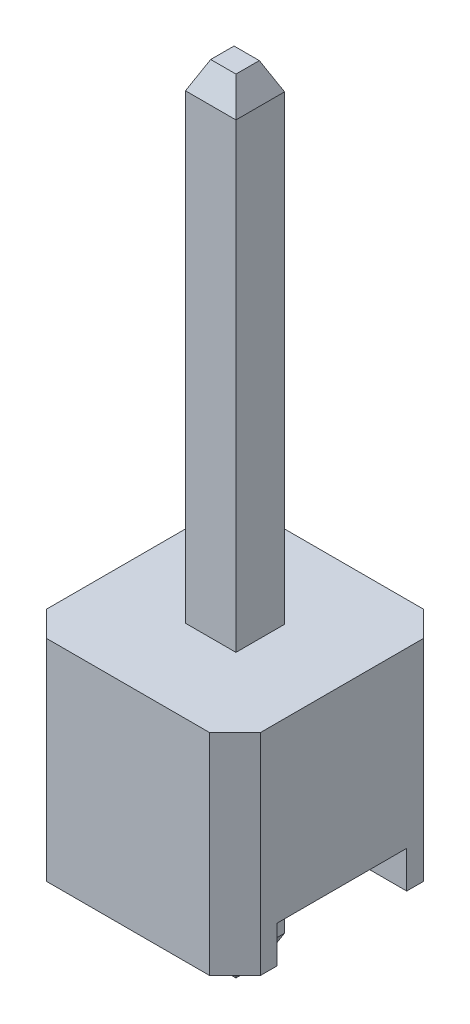
ISO-10303-21;
HEADER;
FILE_DESCRIPTION(('STEP AP214'),'2;1');
FILE_NAME('part.step','',(''),(''),'','','');
FILE_SCHEMA(('AUTOMOTIVE_DESIGN { 1 0 10303 214 1 1 1 1 }'));
ENDSEC;
DATA;
#1=APPLICATION_CONTEXT('core data for automotive mechanical design processes');
#2=APPLICATION_PROTOCOL_DEFINITION('international standard','automotive_design',2000,#1);
#3=PRODUCT_CONTEXT('',#1,'mechanical');
#4=PRODUCT('Part','Part','',(#3));
#5=PRODUCT_RELATED_PRODUCT_CATEGORY('part','',(#4));
#6=PRODUCT_DEFINITION_FORMATION('','',#4);
#7=PRODUCT_DEFINITION_CONTEXT('part definition',#1,'design');
#8=PRODUCT_DEFINITION('design','',#6,#7);
#9=PRODUCT_DEFINITION_SHAPE('','',#8);
#10=(LENGTH_UNIT() NAMED_UNIT(*) SI_UNIT(.MILLI.,.METRE.));
#11=(NAMED_UNIT(*) PLANE_ANGLE_UNIT() SI_UNIT($,.RADIAN.));
#12=(NAMED_UNIT(*) SI_UNIT($,.STERADIAN.) SOLID_ANGLE_UNIT());
#13=UNCERTAINTY_MEASURE_WITH_UNIT(LENGTH_MEASURE(1.E-05),#10,'distance_accuracy_value','');
#14=(GEOMETRIC_REPRESENTATION_CONTEXT(3) GLOBAL_UNCERTAINTY_ASSIGNED_CONTEXT((#13)) GLOBAL_UNIT_ASSIGNED_CONTEXT((#10,
#11,#12)) REPRESENTATION_CONTEXT('',''));
#15=CARTESIAN_POINT('',(0.,0.,0.));
#16=DIRECTION('',(0.,0.,1.));
#17=DIRECTION('',(1.,0.,0.));
#18=AXIS2_PLACEMENT_3D('',#15,#16,#17);
#19=CARTESIAN_POINT('',(13.1274969604626,-5.69124998633488,-0.267125953881936));
#20=DIRECTION('',(0.,-1.,0.));
#21=DIRECTION('',(0.,0.,-1.));
#22=AXIS2_PLACEMENT_3D('',#19,#20,#21);
#23=PLANE('',#22);
#24=DIRECTION('',(1.,0.,0.));
#25=VECTOR('',#24,1.);
#26=CARTESIAN_POINT('',(12.5274969604626,-5.69124998633488,-0.117125953881936));
#27=LINE('',#26,#25);
#28=CARTESIAN_POINT('',(12.6774969604626,-5.69124998633488,-0.117125953881937));
#29=VERTEX_POINT('',#28);
#30=CARTESIAN_POINT('',(12.9774969604626,-5.69124998633488,-0.117125953881937));
#31=VERTEX_POINT('',#30);
#32=EDGE_CURVE('E194',#29,#31,#27,.T.);
#33=ORIENTED_EDGE('',*,*,#32,.T.);
#34=DIRECTION('',(0.,0.,1.));
#35=VECTOR('',#34,1.);
#36=CARTESIAN_POINT('',(12.9774969604626,-5.69124998633488,-0.267125953881936));
#37=LINE('',#36,#35);
#38=CARTESIAN_POINT('',(12.9774969604626,-5.69124998633488,0.160380176225973));
#39=VERTEX_POINT('',#38);
#40=EDGE_CURVE('E179',#31,#39,#37,.T.);
#41=ORIENTED_EDGE('',*,*,#40,.T.);
#42=DIRECTION('',(1.,0.,0.));
#43=VECTOR('',#42,1.);
#44=CARTESIAN_POINT('',(13.1274969604626,-5.69124998633488,0.160380176225973));
#45=LINE('',#44,#43);
#46=CARTESIAN_POINT('',(12.6774969604626,-5.69124998633488,0.160380176225973));
#47=VERTEX_POINT('',#46);
#48=EDGE_CURVE('E20',#39,#47,#45,.F.);
#49=ORIENTED_EDGE('',*,*,#48,.T.);
#50=DIRECTION('',(0.,0.,1.));
#51=VECTOR('',#50,1.);
#52=CARTESIAN_POINT('',(12.6774969604626,-5.69124998633488,0.310380176225972));
#53=LINE('',#52,#51);
#54=EDGE_CURVE('E174',#47,#29,#53,.F.);
#55=ORIENTED_EDGE('',*,*,#54,.T.);
#56=EDGE_LOOP('',(#33,#41,#49,#55));
#57=FACE_BOUND('',#56,.T.);
#58=ADVANCED_FACE('F17',(#57),#23,.T.);
#59=CARTESIAN_POINT('',(13.1274969604626,-5.36957394825845,0.310380176225973));
#60=DIRECTION('',(0.,0.4226182617407,-0.90630778703665));
#61=DIRECTION('',(0.,0.90630778703665,0.4226182617407));
#62=AXIS2_PLACEMENT_3D('',#59,#60,#61);
#63=PLANE('',#62);
#64=DIRECTION('',(1.,0.,0.));
#65=VECTOR('',#64,1.);
#66=CARTESIAN_POINT('',(13.1274969604626,-5.36957394825845,0.310380176225973));
#67=LINE('',#66,#65);
#68=CARTESIAN_POINT('',(12.5274969604626,-5.36957394825845,0.310380176225973));
#69=VERTEX_POINT('',#68);
#70=CARTESIAN_POINT('',(13.1274969604626,-5.36957394825845,0.310380176225973));
#71=VERTEX_POINT('',#70);
#72=EDGE_CURVE('E186',#69,#71,#67,.T.);
#73=ORIENTED_EDGE('',*,*,#72,.F.);
#74=DIRECTION('',(0.389281620635028,-0.834817129478988,-0.389281620635023));
#75=VECTOR('',#74,1.);
#76=CARTESIAN_POINT('',(12.5274969604626,-5.36957394825845,0.310380176225972));
#77=LINE('',#76,#75);
#78=EDGE_CURVE('E182',#69,#47,#77,.T.);
#79=ORIENTED_EDGE('',*,*,#78,.T.);
#80=ORIENTED_EDGE('',*,*,#48,.F.);
#81=DIRECTION('',(0.389281620635028,0.834817129478986,0.389281620635026));
#82=VECTOR('',#81,1.);
#83=CARTESIAN_POINT('',(12.9774969604626,-5.69124998633488,0.160380176225973));
#84=LINE('',#83,#82);
#85=EDGE_CURVE('E202',#39,#71,#84,.T.);
#86=ORIENTED_EDGE('',*,*,#85,.T.);
#87=EDGE_LOOP('',(#73,#79,#80,#86));
#88=FACE_BOUND('',#87,.T.);
#89=ADVANCED_FACE('F184',(#88),#63,.F.);
#90=CARTESIAN_POINT('',(12.5274969604626,-5.36957394825845,0.310380176225972));
#91=DIRECTION('',(0.906307787036649,0.422618261740701,0.));
#92=DIRECTION('',(-0.422618261740701,0.906307787036649,0.));
#93=AXIS2_PLACEMENT_3D('',#90,#91,#92);
#94=PLANE('',#93);
#95=ORIENTED_EDGE('',*,*,#54,.F.);
#96=ORIENTED_EDGE('',*,*,#78,.F.);
#97=DIRECTION('',(0.,0.,1.));
#98=VECTOR('',#97,1.);
#99=CARTESIAN_POINT('',(12.5274969604626,-5.36957394825845,0.310380176225972));
#100=LINE('',#99,#98);
#101=CARTESIAN_POINT('',(12.5274969604626,-5.36957394825845,-0.267125953881937));
#102=VERTEX_POINT('',#101);
#103=EDGE_CURVE('E205',#102,#69,#100,.T.);
#104=ORIENTED_EDGE('',*,*,#103,.F.);
#105=DIRECTION('',(0.389281620635027,-0.834817129478986,0.389281620635026));
#106=VECTOR('',#105,1.);
#107=CARTESIAN_POINT('',(12.5274969604626,-5.36957394825845,-0.267125953881937));
#108=LINE('',#107,#106);
#109=EDGE_CURVE('E191',#102,#29,#108,.T.);
#110=ORIENTED_EDGE('',*,*,#109,.T.);
#111=EDGE_LOOP('',(#95,#96,#104,#110));
#112=FACE_BOUND('',#111,.T.);
#113=ADVANCED_FACE('F189',(#112),#94,.F.);
#114=CARTESIAN_POINT('',(12.5274969604626,-5.36957394825845,-0.267125953881937));
#115=DIRECTION('',(0.,0.422618261740701,0.906307787036649));
#116=DIRECTION('',(0.,-0.906307787036649,0.422618261740701));
#117=AXIS2_PLACEMENT_3D('',#114,#115,#116);
#118=PLANE('',#117);
#119=ORIENTED_EDGE('',*,*,#32,.F.);
#120=ORIENTED_EDGE('',*,*,#109,.F.);
#121=DIRECTION('',(-1.,0.,0.));
#122=VECTOR('',#121,1.);
#123=CARTESIAN_POINT('',(12.5274969604626,-5.36957394825845,-0.267125953881937));
#124=LINE('',#123,#122);
#125=CARTESIAN_POINT('',(13.1274969604626,-5.36957394825845,-0.267125953881936));
#126=VERTEX_POINT('',#125);
#127=EDGE_CURVE('E211',#126,#102,#124,.T.);
#128=ORIENTED_EDGE('',*,*,#127,.F.);
#129=DIRECTION('',(-0.389281620635028,-0.834817129478987,0.389281620635024));
#130=VECTOR('',#129,1.);
#131=CARTESIAN_POINT('',(13.1274969604626,-5.36957394825845,-0.267125953881936));
#132=LINE('',#131,#130);
#133=EDGE_CURVE('E198',#126,#31,#132,.T.);
#134=ORIENTED_EDGE('',*,*,#133,.T.);
#135=EDGE_LOOP('',(#119,#120,#128,#134));
#136=FACE_BOUND('',#135,.T.);
#137=ADVANCED_FACE('F518',(#136),#118,.F.);
#138=CARTESIAN_POINT('',(13.1274969604626,-5.36957394825845,-0.267125953881936));
#139=DIRECTION('',(-0.906307787036649,0.422618261740701,0.));
#140=DIRECTION('',(-0.422618261740701,-0.906307787036649,0.));
#141=AXIS2_PLACEMENT_3D('',#138,#139,#140);
#142=PLANE('',#141);
#143=ORIENTED_EDGE('',*,*,#40,.F.);
#144=ORIENTED_EDGE('',*,*,#133,.F.);
#145=DIRECTION('',(0.,0.,-1.));
#146=VECTOR('',#145,1.);
#147=CARTESIAN_POINT('',(13.1274969604626,-5.36957394825845,-0.267125953881936));
#148=LINE('',#147,#146);
#149=EDGE_CURVE('E220',#71,#126,#148,.T.);
#150=ORIENTED_EDGE('',*,*,#149,.F.);
#151=ORIENTED_EDGE('',*,*,#85,.F.);
#152=EDGE_LOOP('',(#143,#144,#150,#151));
#153=FACE_BOUND('',#152,.T.);
#154=ADVANCED_FACE('F514',(#153),#142,.F.);
#155=CARTESIAN_POINT('',(13.1274969604626,-5.69124998633488,0.310380176225973));
#156=DIRECTION('',(0.,0.,1.));
#157=DIRECTION('',(1.,0.,0.));
#158=AXIS2_PLACEMENT_3D('',#155,#156,#157);
#159=PLANE('',#158);
#160=DIRECTION('',(0.,1.,0.));
#161=VECTOR('',#160,1.);
#162=CARTESIAN_POINT('',(13.1274969604626,-5.69124998633488,0.310380176225973));
#163=LINE('',#162,#161);
#164=CARTESIAN_POINT('',(13.1274969604626,-4.25124998633488,0.310380176225973));
#165=VERTEX_POINT('',#164);
#166=EDGE_CURVE('E217',#165,#71,#163,.F.);
#167=ORIENTED_EDGE('',*,*,#166,.F.);
#168=DIRECTION('',(1.,0.,0.));
#169=VECTOR('',#168,1.);
#170=CARTESIAN_POINT('',(11.5574969604626,-4.25124998633488,0.310380176225973));
#171=LINE('',#170,#169);
#172=CARTESIAN_POINT('',(12.5274969604626,-4.25124998633488,0.310380176225973));
#173=VERTEX_POINT('',#172);
#174=EDGE_CURVE('E230',#165,#173,#171,.F.);
#175=ORIENTED_EDGE('',*,*,#174,.T.);
#176=DIRECTION('',(0.,1.,0.));
#177=VECTOR('',#176,1.);
#178=CARTESIAN_POINT('',(12.5274969604626,-5.69124998633488,0.310380176225972));
#179=LINE('',#178,#177);
#180=EDGE_CURVE('E208',#69,#173,#179,.T.);
#181=ORIENTED_EDGE('',*,*,#180,.F.);
#182=ORIENTED_EDGE('',*,*,#72,.T.);
#183=EDGE_LOOP('',(#167,#175,#181,#182));
#184=FACE_BOUND('',#183,.T.);
#185=ADVANCED_FACE('F510',(#184),#159,.T.);
#186=CARTESIAN_POINT('',(12.5274969604626,-5.69124998633488,0.310380176225972));
#187=DIRECTION('',(-1.,0.,0.));
#188=DIRECTION('',(0.,0.,1.));
#189=AXIS2_PLACEMENT_3D('',#186,#187,#188);
#190=PLANE('',#189);
#191=ORIENTED_EDGE('',*,*,#180,.T.);
#192=DIRECTION('',(0.,0.,1.));
#193=VECTOR('',#192,1.);
#194=CARTESIAN_POINT('',(12.5274969604626,-4.25124998633488,0.791627111172016));
#195=LINE('',#194,#193);
#196=CARTESIAN_POINT('',(12.5274969604626,-4.25124998633488,-0.267125953881937));
#197=VERTEX_POINT('',#196);
#198=EDGE_CURVE('E232',#173,#197,#195,.F.);
#199=ORIENTED_EDGE('',*,*,#198,.T.);
#200=DIRECTION('',(0.,1.,0.));
#201=VECTOR('',#200,1.);
#202=CARTESIAN_POINT('',(12.5274969604626,-5.69124998633488,-0.267125953881937));
#203=LINE('',#202,#201);
#204=EDGE_CURVE('E214',#102,#197,#203,.T.);
#205=ORIENTED_EDGE('',*,*,#204,.F.);
#206=ORIENTED_EDGE('',*,*,#103,.T.);
#207=EDGE_LOOP('',(#191,#199,#205,#206));
#208=FACE_BOUND('',#207,.T.);
#209=ADVANCED_FACE('F506',(#208),#190,.T.);
#210=CARTESIAN_POINT('',(12.5274969604626,-5.69124998633488,-0.267125953881937));
#211=DIRECTION('',(0.,0.,-1.));
#212=DIRECTION('',(-1.,0.,0.));
#213=AXIS2_PLACEMENT_3D('',#210,#211,#212);
#214=PLANE('',#213);
#215=ORIENTED_EDGE('',*,*,#204,.T.);
#216=DIRECTION('',(1.,0.,0.));
#217=VECTOR('',#216,1.);
#218=CARTESIAN_POINT('',(11.5574969604626,-4.25124998633488,-0.267125953881937));
#219=LINE('',#218,#217);
#220=CARTESIAN_POINT('',(13.1274969604626,-4.25124998633488,-0.267125953881937));
#221=VERTEX_POINT('',#220);
#222=EDGE_CURVE('E234',#197,#221,#219,.T.);
#223=ORIENTED_EDGE('',*,*,#222,.T.);
#224=DIRECTION('',(0.,1.,0.));
#225=VECTOR('',#224,1.);
#226=CARTESIAN_POINT('',(13.1274969604626,-5.69124998633488,-0.267125953881936));
#227=LINE('',#226,#225);
#228=EDGE_CURVE('E223',#126,#221,#227,.T.);
#229=ORIENTED_EDGE('',*,*,#228,.F.);
#230=ORIENTED_EDGE('',*,*,#127,.T.);
#231=EDGE_LOOP('',(#215,#223,#229,#230));
#232=FACE_BOUND('',#231,.T.);
#233=ADVANCED_FACE('F502',(#232),#214,.T.);
#234=CARTESIAN_POINT('',(13.1274969604626,-5.69124998633488,-0.267125953881936));
#235=DIRECTION('',(1.,0.,0.));
#236=DIRECTION('',(0.,0.,-1.));
#237=AXIS2_PLACEMENT_3D('',#234,#235,#236);
#238=PLANE('',#237);
#239=ORIENTED_EDGE('',*,*,#228,.T.);
#240=DIRECTION('',(0.,0.,1.));
#241=VECTOR('',#240,1.);
#242=CARTESIAN_POINT('',(13.1274969604626,-4.25124998633488,0.791627111172016));
#243=LINE('',#242,#241);
#244=EDGE_CURVE('E236',#221,#165,#243,.T.);
#245=ORIENTED_EDGE('',*,*,#244,.T.);
#246=ORIENTED_EDGE('',*,*,#166,.T.);
#247=ORIENTED_EDGE('',*,*,#149,.T.);
#248=EDGE_LOOP('',(#239,#245,#246,#247));
#249=FACE_BOUND('',#248,.T.);
#250=ADVANCED_FACE('F498',(#249),#238,.T.);
#251=CARTESIAN_POINT('',(11.5574969604626,-4.25124998633488,0.791627111172016));
#252=DIRECTION('',(0.,1.,0.));
#253=DIRECTION('',(0.,0.,1.));
#254=AXIS2_PLACEMENT_3D('',#251,#252,#253);
#255=PLANE('',#254);
#256=ORIENTED_EDGE('',*,*,#222,.F.);
#257=ORIENTED_EDGE('',*,*,#198,.F.);
#258=ORIENTED_EDGE('',*,*,#174,.F.);
#259=ORIENTED_EDGE('',*,*,#244,.F.);
#260=EDGE_LOOP('',(#256,#257,#258,#259));
#261=FACE_BOUND('',#260,.T.);
#262=DIRECTION('',(-1.,0.,0.));
#263=VECTOR('',#262,1.);
#264=CARTESIAN_POINT('',(11.5574969604626,-4.25124998633488,-0.748372888827984));
#265=LINE('',#264,#263);
#266=CARTESIAN_POINT('',(11.5574969604626,-4.25124998633488,-0.748372888827983));
#267=VERTEX_POINT('',#266);
#268=CARTESIAN_POINT('',(14.0974969604626,-4.25124998633488,-0.748372888827982));
#269=VERTEX_POINT('',#268);
#270=EDGE_CURVE('E241',#267,#269,#265,.F.);
#271=ORIENTED_EDGE('',*,*,#270,.T.);
#272=DIRECTION('',(0.,0.,1.));
#273=VECTOR('',#272,1.);
#274=CARTESIAN_POINT('',(14.0974969604626,-4.25124998633488,0.791627111172016));
#275=LINE('',#274,#273);
#276=CARTESIAN_POINT('',(14.0974969604626,-4.25124998633488,0.791627111172017));
#277=VERTEX_POINT('',#276);
#278=EDGE_CURVE('E226',#277,#269,#275,.F.);
#279=ORIENTED_EDGE('',*,*,#278,.F.);
#280=DIRECTION('',(1.,0.,0.));
#281=VECTOR('',#280,1.);
#282=CARTESIAN_POINT('',(11.5574969604626,-4.25124998633488,0.791627111172016));
#283=LINE('',#282,#281);
#284=CARTESIAN_POINT('',(11.5574969604626,-4.25124998633488,0.791627111172016));
#285=VERTEX_POINT('',#284);
#286=EDGE_CURVE('E248',#277,#285,#283,.F.);
#287=ORIENTED_EDGE('',*,*,#286,.T.);
#288=DIRECTION('',(0.,0.,1.));
#289=VECTOR('',#288,1.);
#290=CARTESIAN_POINT('',(11.5574969604626,-4.25124998633488,0.791627111172016));
#291=LINE('',#290,#289);
#292=EDGE_CURVE('E228',#267,#285,#291,.T.);
#293=ORIENTED_EDGE('',*,*,#292,.F.);
#294=EDGE_LOOP('',(#271,#279,#287,#293));
#295=FACE_BOUND('',#294,.T.);
#296=ADVANCED_FACE('F495',(#261,#295),#255,.F.);
#297=CARTESIAN_POINT('',(12.9774969604626,3.60875001366512,-0.267125953881936));
#298=DIRECTION('',(0.906307787036651,0.422618261740697,0.));
#299=DIRECTION('',(-0.422618261740697,0.906307787036651,0.));
#300=AXIS2_PLACEMENT_3D('',#297,#298,#299);
#301=PLANE('',#300);
#302=DIRECTION('',(0.389281620635021,-0.83481712947899,-0.389281620635023));
#303=VECTOR('',#302,1.);
#304=CARTESIAN_POINT('',(12.9774969604626,3.60875001366512,-0.117125953881936));
#305=LINE('',#304,#303);
#306=CARTESIAN_POINT('',(12.9774969604626,3.60875001366512,-0.117125953881937));
#307=VERTEX_POINT('',#306);
#308=CARTESIAN_POINT('',(13.1274969604626,3.28707397558869,-0.267125953881936));
#309=VERTEX_POINT('',#308);
#310=EDGE_CURVE('E263',#307,#309,#305,.T.);
#311=ORIENTED_EDGE('',*,*,#310,.F.);
#312=DIRECTION('',(0.,0.,-1.));
#313=VECTOR('',#312,1.);
#314=CARTESIAN_POINT('',(12.9774969604626,3.60875001366512,-0.267125953881936));
#315=LINE('',#314,#313);
#316=CARTESIAN_POINT('',(12.9774969604626,3.60875001366512,0.160380176225973));
#317=VERTEX_POINT('',#316);
#318=EDGE_CURVE('E256',#307,#317,#315,.F.);
#319=ORIENTED_EDGE('',*,*,#318,.T.);
#320=DIRECTION('',(-0.389281620635021,0.83481712947899,-0.389281620635024));
#321=VECTOR('',#320,1.);
#322=CARTESIAN_POINT('',(13.1274969604626,3.28707397558869,0.310380176225973));
#323=LINE('',#322,#321);
#324=CARTESIAN_POINT('',(13.1274969604626,3.28707397558869,0.310380176225973));
#325=VERTEX_POINT('',#324);
#326=EDGE_CURVE('E253',#325,#317,#323,.T.);
#327=ORIENTED_EDGE('',*,*,#326,.F.);
#328=DIRECTION('',(0.,0.,-1.));
#329=VECTOR('',#328,1.);
#330=CARTESIAN_POINT('',(13.1274969604626,3.28707397558869,-0.267125953881936));
#331=LINE('',#330,#329);
#332=EDGE_CURVE('E266',#309,#325,#331,.F.);
#333=ORIENTED_EDGE('',*,*,#332,.F.);
#334=EDGE_LOOP('',(#311,#319,#327,#333));
#335=FACE_BOUND('',#334,.T.);
#336=ADVANCED_FACE('F472',(#335),#301,.T.);
#337=CARTESIAN_POINT('',(11.5574969604626,-4.25124998633488,-0.748372888827984));
#338=DIRECTION('',(0.,0.,-1.));
#339=DIRECTION('',(-1.,0.,0.));
#340=AXIS2_PLACEMENT_3D('',#337,#338,#339);
#341=PLANE('',#340);
#342=DIRECTION('',(0.,1.,0.));
#343=VECTOR('',#342,1.);
#344=CARTESIAN_POINT('',(14.0974969604626,-4.25124998633488,-0.748372888827984));
#345=LINE('',#344,#343);
#346=CARTESIAN_POINT('',(14.0974969604626,-4.69124998633488,-0.748372888827983));
#347=VERTEX_POINT('',#346);
#348=EDGE_CURVE('E244',#269,#347,#345,.F.);
#349=ORIENTED_EDGE('',*,*,#348,.F.);
#350=ORIENTED_EDGE('',*,*,#270,.F.);
#351=DIRECTION('',(0.,1.,0.));
#352=VECTOR('',#351,1.);
#353=CARTESIAN_POINT('',(11.5574969604626,-4.25124998633488,-0.748372888827984));
#354=LINE('',#353,#352);
#355=CARTESIAN_POINT('',(11.5574969604626,-4.69124998633488,-0.748372888827984));
#356=VERTEX_POINT('',#355);
#357=EDGE_CURVE('E239',#356,#267,#354,.T.);
#358=ORIENTED_EDGE('',*,*,#357,.F.);
#359=DIRECTION('',(1.,0.,0.));
#360=VECTOR('',#359,1.);
#361=CARTESIAN_POINT('',(12.8274969604626,-4.69124998633488,-0.748372888827983));
#362=LINE('',#361,#360);
#363=EDGE_CURVE('E273',#356,#347,#362,.T.);
#364=ORIENTED_EDGE('',*,*,#363,.T.);
#365=EDGE_LOOP('',(#349,#350,#358,#364));
#366=FACE_BOUND('',#365,.T.);
#367=ADVANCED_FACE('F488',(#366),#341,.F.);
#368=CARTESIAN_POINT('',(11.5574969604626,-4.25124998633488,0.791627111172016));
#369=DIRECTION('',(0.,0.,1.));
#370=DIRECTION('',(1.,0.,0.));
#371=AXIS2_PLACEMENT_3D('',#368,#369,#370);
#372=PLANE('',#371);
#373=DIRECTION('',(0.,1.,0.));
#374=VECTOR('',#373,1.);
#375=CARTESIAN_POINT('',(11.5574969604626,-4.25124998633488,0.791627111172016));
#376=LINE('',#375,#374);
#377=CARTESIAN_POINT('',(11.5574969604626,-4.69124998633488,0.791627111172017));
#378=VERTEX_POINT('',#377);
#379=EDGE_CURVE('E251',#285,#378,#376,.F.);
#380=ORIENTED_EDGE('',*,*,#379,.F.);
#381=ORIENTED_EDGE('',*,*,#286,.F.);
#382=DIRECTION('',(0.,1.,0.));
#383=VECTOR('',#382,1.);
#384=CARTESIAN_POINT('',(14.0974969604626,-4.25124998633488,0.791627111172016));
#385=LINE('',#384,#383);
#386=CARTESIAN_POINT('',(14.0974969604626,-4.69124998633488,0.791627111172018));
#387=VERTEX_POINT('',#386);
#388=EDGE_CURVE('E246',#387,#277,#385,.T.);
#389=ORIENTED_EDGE('',*,*,#388,.F.);
#390=DIRECTION('',(1.,0.,0.));
#391=VECTOR('',#390,1.);
#392=CARTESIAN_POINT('',(12.8274969604626,-4.69124998633488,0.791627111172019));
#393=LINE('',#392,#391);
#394=EDGE_CURVE('E288',#387,#378,#393,.F.);
#395=ORIENTED_EDGE('',*,*,#394,.T.);
#396=EDGE_LOOP('',(#380,#381,#389,#395));
#397=FACE_BOUND('',#396,.T.);
#398=ADVANCED_FACE('F482',(#397),#372,.F.);
#399=CARTESIAN_POINT('',(13.1274969604626,3.60875001366512,0.160380176225973));
#400=DIRECTION('',(0.,0.422618261740697,0.906307787036651));
#401=DIRECTION('',(0.,-0.906307787036651,0.422618261740697));
#402=AXIS2_PLACEMENT_3D('',#399,#400,#401);
#403=PLANE('',#402);
#404=ORIENTED_EDGE('',*,*,#326,.T.);
#405=DIRECTION('',(1.,0.,0.));
#406=VECTOR('',#405,1.);
#407=CARTESIAN_POINT('',(13.1274969604626,3.60875001366512,0.160380176225973));
#408=LINE('',#407,#406);
#409=CARTESIAN_POINT('',(12.6774969604626,3.60875001366512,0.160380176225973));
#410=VERTEX_POINT('',#409);
#411=EDGE_CURVE('E258',#317,#410,#408,.F.);
#412=ORIENTED_EDGE('',*,*,#411,.T.);
#413=DIRECTION('',(0.389281620635025,0.83481712947899,-0.38928162063502));
#414=VECTOR('',#413,1.);
#415=CARTESIAN_POINT('',(12.5274969604626,3.28707397558869,0.310380176225972));
#416=LINE('',#415,#414);
#417=CARTESIAN_POINT('',(12.5274969604626,3.28707397558869,0.310380176225973));
#418=VERTEX_POINT('',#417);
#419=EDGE_CURVE('E310',#418,#410,#416,.T.);
#420=ORIENTED_EDGE('',*,*,#419,.F.);
#421=DIRECTION('',(1.,0.,0.));
#422=VECTOR('',#421,1.);
#423=CARTESIAN_POINT('',(13.1274969604626,3.28707397558869,0.310380176225973));
#424=LINE('',#423,#422);
#425=EDGE_CURVE('E303',#325,#418,#424,.F.);
#426=ORIENTED_EDGE('',*,*,#425,.F.);
#427=EDGE_LOOP('',(#404,#412,#420,#426));
#428=FACE_BOUND('',#427,.T.);
#429=ADVANCED_FACE('F466',(#428),#403,.T.);
#430=CARTESIAN_POINT('',(13.1274969604626,3.60875001366512,-0.267125953881936));
#431=DIRECTION('',(0.,-1.,0.));
#432=DIRECTION('',(0.,0.,-1.));
#433=AXIS2_PLACEMENT_3D('',#430,#431,#432);
#434=PLANE('',#433);
#435=ORIENTED_EDGE('',*,*,#318,.F.);
#436=DIRECTION('',(1.,0.,0.));
#437=VECTOR('',#436,1.);
#438=CARTESIAN_POINT('',(13.1274969604626,3.60875001366512,-0.117125953881936));
#439=LINE('',#438,#437);
#440=CARTESIAN_POINT('',(12.6774969604626,3.60875001366512,-0.117125953881937));
#441=VERTEX_POINT('',#440);
#442=EDGE_CURVE('E260',#441,#307,#439,.T.);
#443=ORIENTED_EDGE('',*,*,#442,.F.);
#444=DIRECTION('',(0.,0.,1.));
#445=VECTOR('',#444,1.);
#446=CARTESIAN_POINT('',(12.6774969604626,3.60875001366512,-0.267125953881936));
#447=LINE('',#446,#445);
#448=EDGE_CURVE('E313',#410,#441,#447,.F.);
#449=ORIENTED_EDGE('',*,*,#448,.F.);
#450=ORIENTED_EDGE('',*,*,#411,.F.);
#451=EDGE_LOOP('',(#435,#443,#449,#450));
#452=FACE_BOUND('',#451,.T.);
#453=ADVANCED_FACE('F474',(#452),#434,.F.);
#454=CARTESIAN_POINT('',(13.1274969604626,3.60875001366512,-0.117125953881936));
#455=DIRECTION('',(0.,0.422618261740697,-0.906307787036651));
#456=DIRECTION('',(0.,0.906307787036651,0.422618261740697));
#457=AXIS2_PLACEMENT_3D('',#454,#455,#456);
#458=PLANE('',#457);
#459=ORIENTED_EDGE('',*,*,#310,.T.);
#460=DIRECTION('',(-1.,0.,0.));
#461=VECTOR('',#460,1.);
#462=CARTESIAN_POINT('',(12.5274969604626,3.28707397558869,-0.267125953881937));
#463=LINE('',#462,#461);
#464=CARTESIAN_POINT('',(12.5274969604626,3.28707397558869,-0.267125953881937));
#465=VERTEX_POINT('',#464);
#466=EDGE_CURVE('E316',#465,#309,#463,.F.);
#467=ORIENTED_EDGE('',*,*,#466,.F.);
#468=DIRECTION('',(-0.389281620635024,-0.83481712947899,-0.389281620635022));
#469=VECTOR('',#468,1.);
#470=CARTESIAN_POINT('',(12.6774969604626,3.60875001366512,-0.117125953881937));
#471=LINE('',#470,#469);
#472=EDGE_CURVE('E307',#441,#465,#471,.T.);
#473=ORIENTED_EDGE('',*,*,#472,.F.);
#474=ORIENTED_EDGE('',*,*,#442,.T.);
#475=EDGE_LOOP('',(#459,#467,#473,#474));
#476=FACE_BOUND('',#475,.T.);
#477=ADVANCED_FACE('F471',(#476),#458,.T.);
#478=CARTESIAN_POINT('',(13.1274969604626,-5.69124998633488,-0.267125953881936));
#479=DIRECTION('',(1.,0.,0.));
#480=DIRECTION('',(0.,0.,-1.));
#481=AXIS2_PLACEMENT_3D('',#478,#479,#480);
#482=PLANE('',#481);
#483=DIRECTION('',(0.,1.,0.));
#484=VECTOR('',#483,1.);
#485=CARTESIAN_POINT('',(13.1274969604626,-5.69124998633488,0.310380176225973));
#486=LINE('',#485,#484);
#487=CARTESIAN_POINT('',(13.1274969604626,-2.19124998633488,0.310380176225973));
#488=VERTEX_POINT('',#487);
#489=EDGE_CURVE('E300',#488,#325,#486,.T.);
#490=ORIENTED_EDGE('',*,*,#489,.F.);
#491=DIRECTION('',(0.,0.,-1.));
#492=VECTOR('',#491,1.);
#493=CARTESIAN_POINT('',(13.1274969604626,-2.19124998633488,-0.267125953881936));
#494=LINE('',#493,#492);
#495=CARTESIAN_POINT('',(13.1274969604626,-2.19124998633488,-0.267125953881936));
#496=VERTEX_POINT('',#495);
#497=EDGE_CURVE('E269',#488,#496,#494,.T.);
#498=ORIENTED_EDGE('',*,*,#497,.T.);
#499=DIRECTION('',(0.,1.,0.));
#500=VECTOR('',#499,1.);
#501=CARTESIAN_POINT('',(13.1274969604626,-5.69124998633488,-0.267125953881937));
#502=LINE('',#501,#500);
#503=EDGE_CURVE('E319',#309,#496,#502,.F.);
#504=ORIENTED_EDGE('',*,*,#503,.F.);
#505=ORIENTED_EDGE('',*,*,#332,.T.);
#506=EDGE_LOOP('',(#490,#498,#504,#505));
#507=FACE_BOUND('',#506,.T.);
#508=ADVANCED_FACE('F462',(#507),#482,.T.);
#509=CARTESIAN_POINT('',(12.8274969604626,-4.69124998633488,-2.21837288882799));
#510=DIRECTION('',(0.,1.,0.));
#511=DIRECTION('',(0.,0.,1.));
#512=AXIS2_PLACEMENT_3D('',#509,#510,#511);
#513=PLANE('',#512);
#514=ORIENTED_EDGE('',*,*,#363,.F.);
#515=DIRECTION('',(0.,0.,1.));
#516=VECTOR('',#515,1.);
#517=CARTESIAN_POINT('',(11.5574969604626,-4.69124998633488,-2.21837288882799));
#518=LINE('',#517,#516);
#519=CARTESIAN_POINT('',(11.5574969604626,-4.69124998633488,-0.948372888827984));
#520=VERTEX_POINT('',#519);
#521=EDGE_CURVE('E271',#520,#356,#518,.T.);
#522=ORIENTED_EDGE('',*,*,#521,.F.);
#523=DIRECTION('',(0.707106781186547,0.,-0.707106781186548));
#524=VECTOR('',#523,1.);
#525=CARTESIAN_POINT('',(11.8574969604626,-4.69124998633488,-1.24837288882798));
#526=LINE('',#525,#524);
#527=CARTESIAN_POINT('',(11.8574969604626,-4.69124998633488,-1.24837288882798));
#528=VERTEX_POINT('',#527);
#529=EDGE_CURVE('E280',#520,#528,#526,.T.);
#530=ORIENTED_EDGE('',*,*,#529,.T.);
#531=DIRECTION('',(1.,0.,0.));
#532=VECTOR('',#531,1.);
#533=CARTESIAN_POINT('',(13.7974969604626,-4.69124998633488,-1.24837288882798));
#534=LINE('',#533,#532);
#535=CARTESIAN_POINT('',(13.7974969604626,-4.69124998633488,-1.24837288882798));
#536=VERTEX_POINT('',#535);
#537=EDGE_CURVE('E330',#528,#536,#534,.T.);
#538=ORIENTED_EDGE('',*,*,#537,.T.);
#539=DIRECTION('',(0.707106781186546,0.,0.707106781186549));
#540=VECTOR('',#539,1.);
#541=CARTESIAN_POINT('',(14.0974969604626,-4.69124998633488,-0.948372888827982));
#542=LINE('',#541,#540);
#543=CARTESIAN_POINT('',(14.0974969604626,-4.69124998633488,-0.948372888827982));
#544=VERTEX_POINT('',#543);
#545=EDGE_CURVE('E297',#536,#544,#542,.T.);
#546=ORIENTED_EDGE('',*,*,#545,.T.);
#547=DIRECTION('',(0.,0.,1.));
#548=VECTOR('',#547,1.);
#549=CARTESIAN_POINT('',(14.0974969604626,-4.69124998633488,-2.21837288882799));
#550=LINE('',#549,#548);
#551=EDGE_CURVE('E276',#347,#544,#550,.F.);
#552=ORIENTED_EDGE('',*,*,#551,.F.);
#553=EDGE_LOOP('',(#514,#522,#530,#538,#546,#552));
#554=FACE_BOUND('',#553,.T.);
#555=ADVANCED_FACE('F630',(#554),#513,.F.);
#556=CARTESIAN_POINT('',(11.8574969604626,-2.19124998633488,-1.24837288882798));
#557=DIRECTION('',(0.707106781186548,0.,0.707106781186547));
#558=DIRECTION('',(0.707106781186547,0.,-0.707106781186548));
#559=AXIS2_PLACEMENT_3D('',#556,#557,#558);
#560=PLANE('',#559);
#561=DIRECTION('',(0.,1.,0.));
#562=VECTOR('',#561,1.);
#563=CARTESIAN_POINT('',(11.5574969604626,-2.19124998633488,-0.948372888827984));
#564=LINE('',#563,#562);
#565=CARTESIAN_POINT('',(11.5574969604626,-2.19124998633488,-0.948372888827984));
#566=VERTEX_POINT('',#565);
#567=EDGE_CURVE('E333',#520,#566,#564,.T.);
#568=ORIENTED_EDGE('',*,*,#567,.T.);
#569=DIRECTION('',(0.707106781186547,0.,-0.707106781186548));
#570=VECTOR('',#569,1.);
#571=CARTESIAN_POINT('',(11.8574969604626,-2.19124998633488,-1.24837288882798));
#572=LINE('',#571,#570);
#573=CARTESIAN_POINT('',(11.8574969604626,-2.19124998633488,-1.24837288882798));
#574=VERTEX_POINT('',#573);
#575=EDGE_CURVE('E278',#574,#566,#572,.F.);
#576=ORIENTED_EDGE('',*,*,#575,.F.);
#577=DIRECTION('',(0.,1.,0.));
#578=VECTOR('',#577,1.);
#579=CARTESIAN_POINT('',(11.8574969604626,-2.19124998633488,-1.24837288882798));
#580=LINE('',#579,#578);
#581=EDGE_CURVE('E327',#574,#528,#580,.F.);
#582=ORIENTED_EDGE('',*,*,#581,.T.);
#583=ORIENTED_EDGE('',*,*,#529,.F.);
#584=EDGE_LOOP('',(#568,#576,#582,#583));
#585=FACE_BOUND('',#584,.T.);
#586=ADVANCED_FACE('F395',(#585),#560,.F.);
#587=CARTESIAN_POINT('',(11.5574969604626,-2.19124998633488,0.991627111172018));
#588=DIRECTION('',(0.707106781186547,0.,-0.707106781186548));
#589=DIRECTION('',(-0.707106781186548,0.,-0.707106781186547));
#590=AXIS2_PLACEMENT_3D('',#587,#588,#589);
#591=PLANE('',#590);
#592=DIRECTION('',(0.,1.,0.));
#593=VECTOR('',#592,1.);
#594=CARTESIAN_POINT('',(11.8574969604626,-2.19124998633488,1.29162711117202));
#595=LINE('',#594,#593);
#596=CARTESIAN_POINT('',(11.8574969604626,-4.69124998633488,1.29162711117202));
#597=VERTEX_POINT('',#596);
#598=CARTESIAN_POINT('',(11.8574969604626,-2.19124998633488,1.29162711117202));
#599=VERTEX_POINT('',#598);
#600=EDGE_CURVE('E341',#597,#599,#595,.T.);
#601=ORIENTED_EDGE('',*,*,#600,.T.);
#602=DIRECTION('',(-0.707106781186548,0.,-0.707106781186547));
#603=VECTOR('',#602,1.);
#604=CARTESIAN_POINT('',(11.5574969604626,-2.19124998633488,0.991627111172018));
#605=LINE('',#604,#603);
#606=CARTESIAN_POINT('',(11.5574969604626,-2.19124998633488,0.991627111172018));
#607=VERTEX_POINT('',#606);
#608=EDGE_CURVE('E282',#607,#599,#605,.F.);
#609=ORIENTED_EDGE('',*,*,#608,.F.);
#610=DIRECTION('',(0.,1.,0.));
#611=VECTOR('',#610,1.);
#612=CARTESIAN_POINT('',(11.5574969604626,-2.19124998633488,0.991627111172018));
#613=LINE('',#612,#611);
#614=CARTESIAN_POINT('',(11.5574969604626,-4.69124998633488,0.991627111172018));
#615=VERTEX_POINT('',#614);
#616=EDGE_CURVE('E336',#607,#615,#613,.F.);
#617=ORIENTED_EDGE('',*,*,#616,.T.);
#618=DIRECTION('',(0.707106781186549,0.,0.707106781186547));
#619=VECTOR('',#618,1.);
#620=CARTESIAN_POINT('',(11.5574969604626,-4.69124998633488,0.991627111172018));
#621=LINE('',#620,#619);
#622=EDGE_CURVE('E284',#615,#597,#621,.T.);
#623=ORIENTED_EDGE('',*,*,#622,.T.);
#624=EDGE_LOOP('',(#601,#609,#617,#623));
#625=FACE_BOUND('',#624,.T.);
#626=ADVANCED_FACE('F402',(#625),#591,.F.);
#627=CARTESIAN_POINT('',(12.8274969604626,-4.69124998633488,-2.21837288882799));
#628=DIRECTION('',(0.,1.,0.));
#629=DIRECTION('',(0.,0.,1.));
#630=AXIS2_PLACEMENT_3D('',#627,#628,#629);
#631=PLANE('',#630);
#632=ORIENTED_EDGE('',*,*,#394,.F.);
#633=DIRECTION('',(0.,0.,1.));
#634=VECTOR('',#633,1.);
#635=CARTESIAN_POINT('',(14.0974969604626,-4.69124998633488,-2.21837288882799));
#636=LINE('',#635,#634);
#637=CARTESIAN_POINT('',(14.0974969604626,-4.69124998633488,0.99162711117202));
#638=VERTEX_POINT('',#637);
#639=EDGE_CURVE('E286',#638,#387,#636,.F.);
#640=ORIENTED_EDGE('',*,*,#639,.F.);
#641=DIRECTION('',(-0.707106781186549,0.,0.707106781186546));
#642=VECTOR('',#641,1.);
#643=CARTESIAN_POINT('',(13.7974969604626,-4.69124998633488,1.29162711117202));
#644=LINE('',#643,#642);
#645=CARTESIAN_POINT('',(13.7974969604626,-4.69124998633488,1.29162711117202));
#646=VERTEX_POINT('',#645);
#647=EDGE_CURVE('E293',#638,#646,#644,.T.);
#648=ORIENTED_EDGE('',*,*,#647,.T.);
#649=DIRECTION('',(-1.,0.,0.));
#650=VECTOR('',#649,1.);
#651=CARTESIAN_POINT('',(11.8574969604626,-4.69124998633488,1.29162711117202));
#652=LINE('',#651,#650);
#653=EDGE_CURVE('E347',#646,#597,#652,.T.);
#654=ORIENTED_EDGE('',*,*,#653,.T.);
#655=ORIENTED_EDGE('',*,*,#622,.F.);
#656=DIRECTION('',(0.,0.,-1.));
#657=VECTOR('',#656,1.);
#658=CARTESIAN_POINT('',(11.5574969604626,-4.69124998633488,-0.948372888827984));
#659=LINE('',#658,#657);
#660=EDGE_CURVE('E338',#615,#378,#659,.T.);
#661=ORIENTED_EDGE('',*,*,#660,.T.);
#662=EDGE_LOOP('',(#632,#640,#648,#654,#655,#661));
#663=FACE_BOUND('',#662,.T.);
#664=ADVANCED_FACE('F405',(#663),#631,.F.);
#665=CARTESIAN_POINT('',(13.7974969604626,-2.19124998633488,1.29162711117202));
#666=DIRECTION('',(-0.707106781186546,0.,-0.707106781186549));
#667=DIRECTION('',(-0.707106781186549,0.,0.707106781186546));
#668=AXIS2_PLACEMENT_3D('',#665,#666,#667);
#669=PLANE('',#668);
#670=DIRECTION('',(0.,1.,0.));
#671=VECTOR('',#670,1.);
#672=CARTESIAN_POINT('',(14.0974969604626,-2.19124998633488,0.99162711117202));
#673=LINE('',#672,#671);
#674=CARTESIAN_POINT('',(14.0974969604626,-2.19124998633488,0.99162711117202));
#675=VERTEX_POINT('',#674);
#676=EDGE_CURVE('E350',#638,#675,#673,.T.);
#677=ORIENTED_EDGE('',*,*,#676,.T.);
#678=DIRECTION('',(-0.707106781186549,0.,0.707106781186546));
#679=VECTOR('',#678,1.);
#680=CARTESIAN_POINT('',(13.7974969604626,-2.19124998633488,1.29162711117202));
#681=LINE('',#680,#679);
#682=CARTESIAN_POINT('',(13.7974969604626,-2.19124998633488,1.29162711117202));
#683=VERTEX_POINT('',#682);
#684=EDGE_CURVE('E291',#683,#675,#681,.F.);
#685=ORIENTED_EDGE('',*,*,#684,.F.);
#686=DIRECTION('',(0.,1.,0.));
#687=VECTOR('',#686,1.);
#688=CARTESIAN_POINT('',(13.7974969604626,-2.19124998633488,1.29162711117202));
#689=LINE('',#688,#687);
#690=EDGE_CURVE('E344',#683,#646,#689,.F.);
#691=ORIENTED_EDGE('',*,*,#690,.T.);
#692=ORIENTED_EDGE('',*,*,#647,.F.);
#693=EDGE_LOOP('',(#677,#685,#691,#692));
#694=FACE_BOUND('',#693,.T.);
#695=ADVANCED_FACE('F414',(#694),#669,.F.);
#696=CARTESIAN_POINT('',(14.0974969604626,-2.19124998633488,-0.948372888827982));
#697=DIRECTION('',(-0.707106781186549,0.,0.707106781186546));
#698=DIRECTION('',(0.707106781186546,0.,0.707106781186549));
#699=AXIS2_PLACEMENT_3D('',#696,#697,#698);
#700=PLANE('',#699);
#701=DIRECTION('',(0.,1.,0.));
#702=VECTOR('',#701,1.);
#703=CARTESIAN_POINT('',(13.7974969604626,-2.19124998633488,-1.24837288882798));
#704=LINE('',#703,#702);
#705=CARTESIAN_POINT('',(13.7974969604626,-2.19124998633488,-1.24837288882798));
#706=VERTEX_POINT('',#705);
#707=EDGE_CURVE('E324',#536,#706,#704,.T.);
#708=ORIENTED_EDGE('',*,*,#707,.T.);
#709=DIRECTION('',(0.707106781186546,0.,0.707106781186549));
#710=VECTOR('',#709,1.);
#711=CARTESIAN_POINT('',(14.0974969604626,-2.19124998633488,-0.948372888827982));
#712=LINE('',#711,#710);
#713=CARTESIAN_POINT('',(14.0974969604626,-2.19124998633488,-0.948372888827982));
#714=VERTEX_POINT('',#713);
#715=EDGE_CURVE('E295',#714,#706,#712,.F.);
#716=ORIENTED_EDGE('',*,*,#715,.F.);
#717=DIRECTION('',(0.,1.,0.));
#718=VECTOR('',#717,1.);
#719=CARTESIAN_POINT('',(14.0974969604626,-2.19124998633488,-0.948372888827982));
#720=LINE('',#719,#718);
#721=EDGE_CURVE('E353',#714,#544,#720,.F.);
#722=ORIENTED_EDGE('',*,*,#721,.T.);
#723=ORIENTED_EDGE('',*,*,#545,.F.);
#724=EDGE_LOOP('',(#708,#716,#722,#723));
#725=FACE_BOUND('',#724,.T.);
#726=ADVANCED_FACE('F384',(#725),#700,.F.);
#727=CARTESIAN_POINT('',(13.1274969604626,-5.69124998633488,0.310380176225973));
#728=DIRECTION('',(0.,0.,1.));
#729=DIRECTION('',(1.,0.,0.));
#730=AXIS2_PLACEMENT_3D('',#727,#728,#729);
#731=PLANE('',#730);
#732=DIRECTION('',(0.,1.,0.));
#733=VECTOR('',#732,1.);
#734=CARTESIAN_POINT('',(12.5274969604626,-5.69124998633488,0.310380176225972));
#735=LINE('',#734,#733);
#736=CARTESIAN_POINT('',(12.5274969604626,-2.19124998633488,0.310380176225973));
#737=VERTEX_POINT('',#736);
#738=EDGE_CURVE('E356',#737,#418,#735,.T.);
#739=ORIENTED_EDGE('',*,*,#738,.F.);
#740=DIRECTION('',(1.,0.,0.));
#741=VECTOR('',#740,1.);
#742=CARTESIAN_POINT('',(13.1274969604626,-2.19124998633488,0.310380176225973));
#743=LINE('',#742,#741);
#744=EDGE_CURVE('E34',#737,#488,#743,.T.);
#745=ORIENTED_EDGE('',*,*,#744,.T.);
#746=ORIENTED_EDGE('',*,*,#489,.T.);
#747=ORIENTED_EDGE('',*,*,#425,.T.);
#748=EDGE_LOOP('',(#739,#745,#746,#747));
#749=FACE_BOUND('',#748,.T.);
#750=ADVANCED_FACE('F422',(#749),#731,.T.);
#751=CARTESIAN_POINT('',(12.6774969604626,3.60875001366512,-0.267125953881936));
#752=DIRECTION('',(-0.906307787036651,0.422618261740697,0.));
#753=DIRECTION('',(-0.422618261740697,-0.906307787036651,0.));
#754=AXIS2_PLACEMENT_3D('',#751,#752,#753);
#755=PLANE('',#754);
#756=ORIENTED_EDGE('',*,*,#419,.T.);
#757=ORIENTED_EDGE('',*,*,#448,.T.);
#758=ORIENTED_EDGE('',*,*,#472,.T.);
#759=DIRECTION('',(0.,0.,1.));
#760=VECTOR('',#759,1.);
#761=CARTESIAN_POINT('',(12.5274969604626,3.28707397558869,0.310380176225972));
#762=LINE('',#761,#760);
#763=EDGE_CURVE('E359',#418,#465,#762,.F.);
#764=ORIENTED_EDGE('',*,*,#763,.F.);
#765=EDGE_LOOP('',(#756,#757,#758,#764));
#766=FACE_BOUND('',#765,.T.);
#767=ADVANCED_FACE('F445',(#766),#755,.T.);
#768=CARTESIAN_POINT('',(12.5274969604626,-5.69124998633488,-0.267125953881937));
#769=DIRECTION('',(0.,0.,-1.));
#770=DIRECTION('',(-1.,0.,0.));
#771=AXIS2_PLACEMENT_3D('',#768,#769,#770);
#772=PLANE('',#771);
#773=ORIENTED_EDGE('',*,*,#503,.T.);
#774=DIRECTION('',(-1.,0.,0.));
#775=VECTOR('',#774,1.);
#776=CARTESIAN_POINT('',(12.5274969604626,-2.19124998633488,-0.267125953881937));
#777=LINE('',#776,#775);
#778=CARTESIAN_POINT('',(12.5274969604626,-2.19124998633488,-0.267125953881937));
#779=VERTEX_POINT('',#778);
#780=EDGE_CURVE('E322',#496,#779,#777,.T.);
#781=ORIENTED_EDGE('',*,*,#780,.T.);
#782=DIRECTION('',(0.,1.,0.));
#783=VECTOR('',#782,1.);
#784=CARTESIAN_POINT('',(12.5274969604626,-5.69124998633488,-0.267125953881937));
#785=LINE('',#784,#783);
#786=EDGE_CURVE('E362',#465,#779,#785,.F.);
#787=ORIENTED_EDGE('',*,*,#786,.F.);
#788=ORIENTED_EDGE('',*,*,#466,.T.);
#789=EDGE_LOOP('',(#773,#781,#787,#788));
#790=FACE_BOUND('',#789,.T.);
#791=ADVANCED_FACE('F442',(#790),#772,.T.);
#792=CARTESIAN_POINT('',(13.7974969604626,-2.19124998633488,-1.24837288882798));
#793=DIRECTION('',(0.,0.,1.));
#794=DIRECTION('',(1.,0.,0.));
#795=AXIS2_PLACEMENT_3D('',#792,#793,#794);
#796=PLANE('',#795);
#797=ORIENTED_EDGE('',*,*,#581,.F.);
#798=DIRECTION('',(1.,0.,0.));
#799=VECTOR('',#798,1.);
#800=CARTESIAN_POINT('',(12.8274969604626,-2.19124998633488,-1.24837288882798));
#801=LINE('',#800,#799);
#802=EDGE_CURVE('E365',#706,#574,#801,.F.);
#803=ORIENTED_EDGE('',*,*,#802,.F.);
#804=ORIENTED_EDGE('',*,*,#707,.F.);
#805=ORIENTED_EDGE('',*,*,#537,.F.);
#806=EDGE_LOOP('',(#797,#803,#804,#805));
#807=FACE_BOUND('',#806,.T.);
#808=ADVANCED_FACE('F390',(#807),#796,.F.);
#809=CARTESIAN_POINT('',(11.5574969604626,-2.19124998633488,-0.948372888827984));
#810=DIRECTION('',(1.,0.,0.));
#811=DIRECTION('',(0.,0.,-1.));
#812=AXIS2_PLACEMENT_3D('',#809,#810,#811);
#813=PLANE('',#812);
#814=ORIENTED_EDGE('',*,*,#379,.T.);
#815=ORIENTED_EDGE('',*,*,#660,.F.);
#816=ORIENTED_EDGE('',*,*,#616,.F.);
#817=DIRECTION('',(0.,0.,1.));
#818=VECTOR('',#817,1.);
#819=CARTESIAN_POINT('',(11.5574969604626,-2.19124998633488,-2.21837288882799));
#820=LINE('',#819,#818);
#821=EDGE_CURVE('E368',#566,#607,#820,.T.);
#822=ORIENTED_EDGE('',*,*,#821,.F.);
#823=ORIENTED_EDGE('',*,*,#567,.F.);
#824=ORIENTED_EDGE('',*,*,#521,.T.);
#825=ORIENTED_EDGE('',*,*,#357,.T.);
#826=ORIENTED_EDGE('',*,*,#292,.T.);
#827=EDGE_LOOP('',(#814,#815,#816,#822,#823,#824,#825,#826));
#828=FACE_BOUND('',#827,.T.);
#829=ADVANCED_FACE('F398',(#828),#813,.F.);
#830=CARTESIAN_POINT('',(11.8574969604626,-2.19124998633488,1.29162711117202));
#831=DIRECTION('',(0.,0.,-1.));
#832=DIRECTION('',(-1.,0.,0.));
#833=AXIS2_PLACEMENT_3D('',#830,#831,#832);
#834=PLANE('',#833);
#835=ORIENTED_EDGE('',*,*,#690,.F.);
#836=DIRECTION('',(1.,0.,0.));
#837=VECTOR('',#836,1.);
#838=CARTESIAN_POINT('',(12.8274969604626,-2.19124998633488,1.29162711117202));
#839=LINE('',#838,#837);
#840=EDGE_CURVE('E371',#599,#683,#839,.T.);
#841=ORIENTED_EDGE('',*,*,#840,.F.);
#842=ORIENTED_EDGE('',*,*,#600,.F.);
#843=ORIENTED_EDGE('',*,*,#653,.F.);
#844=EDGE_LOOP('',(#835,#841,#842,#843));
#845=FACE_BOUND('',#844,.T.);
#846=ADVANCED_FACE('F412',(#845),#834,.F.);
#847=CARTESIAN_POINT('',(14.0974969604626,-2.19124998633488,0.99162711117202));
#848=DIRECTION('',(-1.,0.,0.));
#849=DIRECTION('',(0.,0.,1.));
#850=AXIS2_PLACEMENT_3D('',#847,#848,#849);
#851=PLANE('',#850);
#852=ORIENTED_EDGE('',*,*,#388,.T.);
#853=ORIENTED_EDGE('',*,*,#278,.T.);
#854=ORIENTED_EDGE('',*,*,#348,.T.);
#855=ORIENTED_EDGE('',*,*,#551,.T.);
#856=ORIENTED_EDGE('',*,*,#721,.F.);
#857=DIRECTION('',(0.,0.,1.));
#858=VECTOR('',#857,1.);
#859=CARTESIAN_POINT('',(14.0974969604626,-2.19124998633488,-2.21837288882799));
#860=LINE('',#859,#858);
#861=EDGE_CURVE('E26',#675,#714,#860,.F.);
#862=ORIENTED_EDGE('',*,*,#861,.F.);
#863=ORIENTED_EDGE('',*,*,#676,.F.);
#864=ORIENTED_EDGE('',*,*,#639,.T.);
#865=EDGE_LOOP('',(#852,#853,#854,#855,#856,#862,#863,#864));
#866=FACE_BOUND('',#865,.T.);
#867=ADVANCED_FACE('F381',(#866),#851,.F.);
#868=CARTESIAN_POINT('',(12.5274969604626,-5.69124998633488,0.310380176225972));
#869=DIRECTION('',(-1.,0.,0.));
#870=DIRECTION('',(0.,0.,1.));
#871=AXIS2_PLACEMENT_3D('',#868,#869,#870);
#872=PLANE('',#871);
#873=ORIENTED_EDGE('',*,*,#786,.T.);
#874=DIRECTION('',(0.,0.,1.));
#875=VECTOR('',#874,1.);
#876=CARTESIAN_POINT('',(12.5274969604626,-2.19124998633488,-2.21837288882799));
#877=LINE('',#876,#875);
#878=EDGE_CURVE('E11',#737,#779,#877,.F.);
#879=ORIENTED_EDGE('',*,*,#878,.F.);
#880=ORIENTED_EDGE('',*,*,#738,.T.);
#881=ORIENTED_EDGE('',*,*,#763,.T.);
#882=EDGE_LOOP('',(#873,#879,#880,#881));
#883=FACE_BOUND('',#882,.T.);
#884=ADVANCED_FACE('F426',(#883),#872,.T.);
#885=CARTESIAN_POINT('',(12.8274969604626,-2.19124998633488,-2.21837288882799));
#886=DIRECTION('',(0.,1.,0.));
#887=DIRECTION('',(0.,0.,1.));
#888=AXIS2_PLACEMENT_3D('',#885,#886,#887);
#889=PLANE('',#888);
#890=ORIENTED_EDGE('',*,*,#744,.F.);
#891=ORIENTED_EDGE('',*,*,#878,.T.);
#892=ORIENTED_EDGE('',*,*,#780,.F.);
#893=ORIENTED_EDGE('',*,*,#497,.F.);
#894=EDGE_LOOP('',(#890,#891,#892,#893));
#895=FACE_BOUND('',#894,.T.);
#896=ORIENTED_EDGE('',*,*,#684,.T.);
#897=ORIENTED_EDGE('',*,*,#861,.T.);
#898=ORIENTED_EDGE('',*,*,#715,.T.);
#899=ORIENTED_EDGE('',*,*,#802,.T.);
#900=ORIENTED_EDGE('',*,*,#575,.T.);
#901=ORIENTED_EDGE('',*,*,#821,.T.);
#902=ORIENTED_EDGE('',*,*,#608,.T.);
#903=ORIENTED_EDGE('',*,*,#840,.T.);
#904=EDGE_LOOP('',(#896,#897,#898,#899,#900,#901,#902,#903));
#905=FACE_BOUND('',#904,.T.);
#906=ADVANCED_FACE('F377',(#895,#905),#889,.T.);
#907=CLOSED_SHELL('',(#58,#89,#113,#137,#154,#185,#209,#233,#250,#296,#336,#367,#398,#429,#453,
#477,#508,#555,#586,#626,#664,#695,#726,#750,#767,#791,#808,#829,#846,#867,#884,#906));
#908=MANIFOLD_SOLID_BREP('B1',#907);
#909=ADVANCED_BREP_SHAPE_REPRESENTATION('',(#18,#908),#14);
#910=SHAPE_DEFINITION_REPRESENTATION(#9,#909);
ENDSEC;
END-ISO-10303-21;
